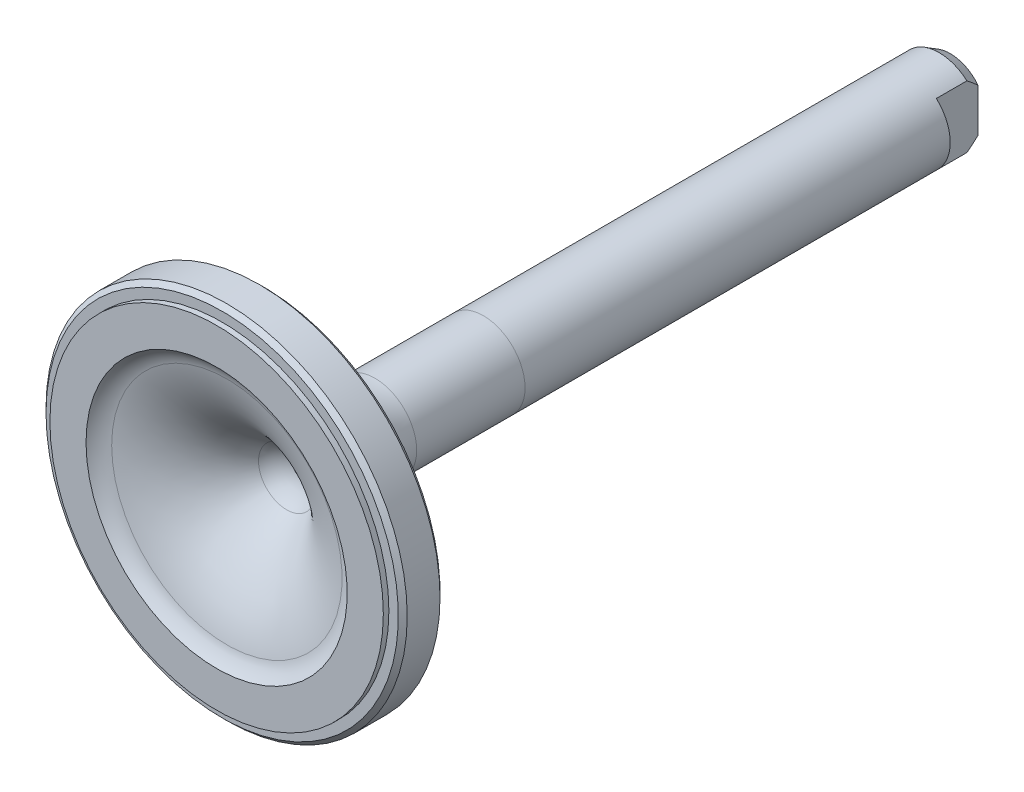
ISO-10303-21;
HEADER;
FILE_DESCRIPTION(('STEP AP214'),'2;1');
FILE_NAME('part.step','',(''),(''),'','','');
FILE_SCHEMA(('AUTOMOTIVE_DESIGN { 1 0 10303 214 1 1 1 1 }'));
ENDSEC;
DATA;
#1=APPLICATION_CONTEXT('core data for automotive mechanical design processes');
#2=APPLICATION_PROTOCOL_DEFINITION('international standard','automotive_design',2000,#1);
#3=PRODUCT_CONTEXT('',#1,'mechanical');
#4=PRODUCT('Part','Part','',(#3));
#5=PRODUCT_RELATED_PRODUCT_CATEGORY('part','',(#4));
#6=PRODUCT_DEFINITION_FORMATION('','',#4);
#7=PRODUCT_DEFINITION_CONTEXT('part definition',#1,'design');
#8=PRODUCT_DEFINITION('design','',#6,#7);
#9=PRODUCT_DEFINITION_SHAPE('','',#8);
#10=(LENGTH_UNIT() NAMED_UNIT(*) SI_UNIT(.MILLI.,.METRE.));
#11=(NAMED_UNIT(*) PLANE_ANGLE_UNIT() SI_UNIT($,.RADIAN.));
#12=(NAMED_UNIT(*) SI_UNIT($,.STERADIAN.) SOLID_ANGLE_UNIT());
#13=UNCERTAINTY_MEASURE_WITH_UNIT(LENGTH_MEASURE(1.E-05),#10,'distance_accuracy_value','');
#14=(GEOMETRIC_REPRESENTATION_CONTEXT(3) GLOBAL_UNCERTAINTY_ASSIGNED_CONTEXT((#13)) GLOBAL_UNIT_ASSIGNED_CONTEXT((#10,
#11,#12)) REPRESENTATION_CONTEXT('',''));
#15=CARTESIAN_POINT('',(0.,0.,0.));
#16=DIRECTION('',(0.,0.,1.));
#17=DIRECTION('',(1.,0.,0.));
#18=AXIS2_PLACEMENT_3D('',#15,#16,#17);
#19=CARTESIAN_POINT('',(0.,0.,-156.845));
#20=DIRECTION('',(0.,0.,1.));
#21=DIRECTION('',(1.,0.,0.));
#22=AXIS2_PLACEMENT_3D('',#19,#20,#21);
#23=CYLINDRICAL_SURFACE('',#22,9.525);
#24=CARTESIAN_POINT('',(0.,0.,-25.4));
#25=DIRECTION('',(0.,0.,1.));
#26=DIRECTION('',(1.,0.,0.));
#27=AXIS2_PLACEMENT_3D('',#24,#25,#26);
#28=CIRCLE('',#27,9.525);
#29=CARTESIAN_POINT('',(9.525,0.,-25.4));
#30=VERTEX_POINT('',#29);
#31=EDGE_CURVE('E168',#30,#30,#28,.F.);
#32=ORIENTED_EDGE('',*,*,#31,.T.);
#33=EDGE_LOOP('',(#32));
#34=FACE_BOUND('',#33,.T.);
#35=CARTESIAN_POINT('',(0.,0.,-50.165));
#36=DIRECTION('',(0.,0.,-1.));
#37=DIRECTION('',(0.,1.,0.));
#38=AXIS2_PLACEMENT_3D('',#35,#36,#37);
#39=CIRCLE('',#38,9.525);
#40=CARTESIAN_POINT('',(0.,9.525,-50.165));
#41=VERTEX_POINT('',#40);
#42=EDGE_CURVE('E13',#41,#41,#39,.T.);
#43=ORIENTED_EDGE('',*,*,#42,.F.);
#44=EDGE_LOOP('',(#43));
#45=FACE_BOUND('',#44,.T.);
#46=ADVANCED_FACE('F51',(#34,#45),#23,.T.);
#47=CARTESIAN_POINT('',(0.,0.,9.525));
#48=DIRECTION('',(0.,0.,1.));
#49=DIRECTION('',(1.,0.,0.));
#50=AXIS2_PLACEMENT_3D('',#47,#48,#49);
#51=PLANE('',#50);
#52=CARTESIAN_POINT('',(0.,0.,9.525));
#53=DIRECTION('',(0.,0.,1.));
#54=DIRECTION('',(1.,0.,0.));
#55=AXIS2_PLACEMENT_3D('',#52,#53,#54);
#56=CIRCLE('',#55,38.1);
#57=CARTESIAN_POINT('',(38.1,0.,9.525));
#58=VERTEX_POINT('',#57);
#59=EDGE_CURVE('E152',#58,#58,#56,.T.);
#60=ORIENTED_EDGE('',*,*,#59,.F.);
#61=EDGE_LOOP('',(#60));
#62=FACE_BOUND('',#61,.T.);
#63=CARTESIAN_POINT('',(0.,0.,9.525));
#64=DIRECTION('',(0.,0.,-1.));
#65=DIRECTION('',(-1.,0.,0.));
#66=AXIS2_PLACEMENT_3D('',#63,#64,#65);
#67=CIRCLE('',#66,40.259);
#68=CARTESIAN_POINT('',(-40.259,0.,9.525));
#69=VERTEX_POINT('',#68);
#70=EDGE_CURVE('E334',#69,#69,#67,.T.);
#71=ORIENTED_EDGE('',*,*,#70,.F.);
#72=EDGE_LOOP('',(#71));
#73=FACE_BOUND('',#72,.T.);
#74=ADVANCED_FACE('F209',(#62,#73),#51,.T.);
#75=CARTESIAN_POINT('',(0.,0.,10.795));
#76=DIRECTION('',(0.,0.,1.));
#77=DIRECTION('',(1.,0.,0.));
#78=AXIS2_PLACEMENT_3D('',#75,#76,#77);
#79=PLANE('',#78);
#80=CARTESIAN_POINT('',(0.,0.,10.795));
#81=DIRECTION('',(0.,0.,1.));
#82=DIRECTION('',(1.,0.,0.));
#83=AXIS2_PLACEMENT_3D('',#80,#81,#82);
#84=CIRCLE('',#83,38.1);
#85=CARTESIAN_POINT('',(38.1,0.,10.795));
#86=VERTEX_POINT('',#85);
#87=EDGE_CURVE('E146',#86,#86,#84,.T.);
#88=ORIENTED_EDGE('',*,*,#87,.T.);
#89=EDGE_LOOP('',(#88));
#90=FACE_BOUND('',#89,.T.);
#91=CARTESIAN_POINT('',(0.,0.,10.795));
#92=DIRECTION('',(0.,0.,-1.));
#93=DIRECTION('',(-1.,0.,0.));
#94=AXIS2_PLACEMENT_3D('',#91,#92,#93);
#95=CIRCLE('',#94,29.845);
#96=CARTESIAN_POINT('',(-29.845,0.,10.795));
#97=VERTEX_POINT('',#96);
#98=EDGE_CURVE('E305',#97,#97,#95,.T.);
#99=ORIENTED_EDGE('',*,*,#98,.T.);
#100=EDGE_LOOP('',(#99));
#101=FACE_BOUND('',#100,.T.);
#102=ADVANCED_FACE('F205',(#90,#101),#79,.T.);
#103=CARTESIAN_POINT('',(0.,0.,9.525));
#104=DIRECTION('',(0.,0.,1.));
#105=DIRECTION('',(1.,0.,0.));
#106=AXIS2_PLACEMENT_3D('',#103,#104,#105);
#107=CYLINDRICAL_SURFACE('',#106,38.1);
#108=ORIENTED_EDGE('',*,*,#59,.T.);
#109=EDGE_LOOP('',(#108));
#110=FACE_BOUND('',#109,.T.);
#111=ORIENTED_EDGE('',*,*,#87,.F.);
#112=EDGE_LOOP('',(#111));
#113=FACE_BOUND('',#112,.T.);
#114=ADVANCED_FACE('F208',(#110,#113),#107,.T.);
#115=CARTESIAN_POINT('',(0.,0.,14.605));
#116=DIRECTION('',(0.,0.,-1.));
#117=DIRECTION('',(-1.,0.,0.));
#118=AXIS2_PLACEMENT_3D('',#115,#116,#117);
#119=TOROIDAL_SURFACE('',#118,24.765,6.35);
#120=CARTESIAN_POINT('',(0.,0.,8.45038461538461));
#121=DIRECTION('',(0.,0.,-1.));
#122=DIRECTION('',(-1.,0.,0.));
#123=AXIS2_PLACEMENT_3D('',#120,#121,#122);
#124=CIRCLE('',#123,26.3280769230769);
#125=CARTESIAN_POINT('',(-26.3280769230769,0.,8.45038461538461));
#126=VERTEX_POINT('',#125);
#127=EDGE_CURVE('E311',#126,#126,#124,.T.);
#128=ORIENTED_EDGE('',*,*,#127,.T.);
#129=EDGE_LOOP('',(#128));
#130=FACE_BOUND('',#129,.T.);
#131=ORIENTED_EDGE('',*,*,#98,.F.);
#132=EDGE_LOOP('',(#131));
#133=FACE_BOUND('',#132,.T.);
#134=ADVANCED_FACE('F258',(#130,#133),#119,.F.);
#135=CARTESIAN_POINT('',(0.,0.,-25.4));
#136=DIRECTION('',(0.,0.,-1.));
#137=DIRECTION('',(-1.,0.,0.));
#138=AXIS2_PLACEMENT_3D('',#135,#136,#137);
#139=DEGENERATE_TOROIDAL_SURFACE('',#138,34.925,34.925,.T.);
#140=CARTESIAN_POINT('',(0.,0.,-5.21270777702834));
#141=DIRECTION('',(0.,0.,-1.));
#142=DIRECTION('',(-1.,0.,0.));
#143=AXIS2_PLACEMENT_3D('',#140,#141,#142);
#144=CIRCLE('',#143,6.4253709198813);
#145=CARTESIAN_POINT('',(-6.4253709198813,0.,-5.21270777702834));
#146=VERTEX_POINT('',#145);
#147=EDGE_CURVE('E314',#146,#146,#144,.T.);
#148=ORIENTED_EDGE('',*,*,#147,.T.);
#149=EDGE_LOOP('',(#148));
#150=FACE_BOUND('',#149,.T.);
#151=ORIENTED_EDGE('',*,*,#127,.F.);
#152=EDGE_LOOP('',(#151));
#153=FACE_BOUND('',#152,.T.);
#154=ADVANCED_FACE('F357',(#150,#153),#139,.T.);
#155=CARTESIAN_POINT('',(0.,0.,-0.661390984940169));
#156=DIRECTION('',(0.,0.,-1.));
#157=DIRECTION('',(1.,0.,0.));
#158=AXIS2_PLACEMENT_3D('',#155,#156,#157);
#159=SPHERICAL_SURFACE('',#158,7.874);
#160=CARTESIAN_POINT('',(0.,0.,-8.37370060981909));
#161=DIRECTION('',(0.,0.,-1.));
#162=DIRECTION('',(-1.,0.,0.));
#163=AXIS2_PLACEMENT_3D('',#160,#161,#162);
#164=CIRCLE('',#163,1.5875);
#165=CARTESIAN_POINT('',(-1.5875,0.,-8.37370060981909));
#166=VERTEX_POINT('',#165);
#167=EDGE_CURVE('E316',#166,#166,#164,.T.);
#168=ORIENTED_EDGE('',*,*,#167,.T.);
#169=EDGE_LOOP('',(#168));
#170=FACE_BOUND('',#169,.T.);
#171=ORIENTED_EDGE('',*,*,#147,.F.);
#172=EDGE_LOOP('',(#171));
#173=FACE_BOUND('',#172,.T.);
#174=ADVANCED_FACE('F353',(#170,#173),#159,.F.);
#175=CARTESIAN_POINT('',(0.,0.,10.795));
#176=DIRECTION('',(0.,0.,-1.));
#177=DIRECTION('',(-1.,0.,0.));
#178=AXIS2_PLACEMENT_3D('',#175,#176,#177);
#179=CYLINDRICAL_SURFACE('',#178,1.5875);
#180=CARTESIAN_POINT('',(0.,0.,-8.91639098494017));
#181=DIRECTION('',(0.,0.,-1.));
#182=DIRECTION('',(-1.,0.,0.));
#183=AXIS2_PLACEMENT_3D('',#180,#181,#182);
#184=CIRCLE('',#183,1.5875);
#185=CARTESIAN_POINT('',(-1.5875,0.,-8.91639098494017));
#186=VERTEX_POINT('',#185);
#187=EDGE_CURVE('E270',#186,#186,#184,.T.);
#188=ORIENTED_EDGE('',*,*,#187,.T.);
#189=EDGE_LOOP('',(#188));
#190=FACE_BOUND('',#189,.T.);
#191=ORIENTED_EDGE('',*,*,#167,.F.);
#192=EDGE_LOOP('',(#191));
#193=FACE_BOUND('',#192,.T.);
#194=ADVANCED_FACE('F346',(#190,#193),#179,.F.);
#195=CARTESIAN_POINT('',(0.,0.,-8.91639098494017));
#196=DIRECTION('',(0.,0.,1.));
#197=DIRECTION('',(1.,0.,0.));
#198=AXIS2_PLACEMENT_3D('',#195,#196,#197);
#199=PLANE('',#198);
#200=ORIENTED_EDGE('',*,*,#187,.F.);
#201=EDGE_LOOP('',(#200));
#202=FACE_BOUND('',#201,.T.);
#203=ADVANCED_FACE('F278',(#202),#199,.T.);
#204=CARTESIAN_POINT('',(0.,0.,8.509));
#205=DIRECTION('',(0.,0.,-1.));
#206=DIRECTION('',(-1.,0.,0.));
#207=AXIS2_PLACEMENT_3D('',#204,#205,#206);
#208=CONICAL_SURFACE('',#207,41.275,0.785398163397448);
#209=ORIENTED_EDGE('',*,*,#70,.T.);
#210=EDGE_LOOP('',(#209));
#211=FACE_BOUND('',#210,.T.);
#212=CARTESIAN_POINT('',(0.,0.,8.509));
#213=DIRECTION('',(0.,0.,-1.));
#214=DIRECTION('',(-1.,0.,0.));
#215=AXIS2_PLACEMENT_3D('',#212,#213,#214);
#216=CIRCLE('',#215,41.275);
#217=CARTESIAN_POINT('',(-41.275,0.,8.509));
#218=VERTEX_POINT('',#217);
#219=EDGE_CURVE('E337',#218,#218,#216,.T.);
#220=ORIENTED_EDGE('',*,*,#219,.F.);
#221=EDGE_LOOP('',(#220));
#222=FACE_BOUND('',#221,.T.);
#223=ADVANCED_FACE('F200',(#211,#222),#208,.T.);
#224=CARTESIAN_POINT('',(0.,0.,-156.845));
#225=DIRECTION('',(0.,0.,-1.));
#226=DIRECTION('',(-1.,0.,0.));
#227=AXIS2_PLACEMENT_3D('',#224,#225,#226);
#228=PLANE('',#227);
#229=CARTESIAN_POINT('',(0.,0.,-156.845));
#230=DIRECTION('',(0.,0.,1.));
#231=DIRECTION('',(1.,0.,0.));
#232=AXIS2_PLACEMENT_3D('',#229,#230,#231);
#233=CIRCLE('',#232,8.05853031625838);
#234=CARTESIAN_POINT('',(-6.35,-4.96159358049965,-156.845));
#235=VERTEX_POINT('',#234);
#236=CARTESIAN_POINT('',(6.35,-4.96159358049965,-156.845));
#237=VERTEX_POINT('',#236);
#238=EDGE_CURVE('E125',#235,#237,#233,.T.);
#239=ORIENTED_EDGE('',*,*,#238,.F.);
#240=DIRECTION('',(0.,1.,0.));
#241=VECTOR('',#240,1.);
#242=CARTESIAN_POINT('',(-6.35,0.,-156.845));
#243=LINE('',#242,#241);
#244=CARTESIAN_POINT('',(-6.35,4.96159358049965,-156.845));
#245=VERTEX_POINT('',#244);
#246=EDGE_CURVE('E303',#235,#245,#243,.T.);
#247=ORIENTED_EDGE('',*,*,#246,.T.);
#248=CARTESIAN_POINT('',(6.35,4.96159358049965,-156.845));
#249=VERTEX_POINT('',#248);
#250=EDGE_CURVE('E68',#249,#245,#233,.T.);
#251=ORIENTED_EDGE('',*,*,#250,.F.);
#252=DIRECTION('',(0.,1.,0.));
#253=VECTOR('',#252,1.);
#254=CARTESIAN_POINT('',(6.35,0.,-156.845));
#255=LINE('',#254,#253);
#256=EDGE_CURVE('E136',#237,#249,#255,.T.);
#257=ORIENTED_EDGE('',*,*,#256,.F.);
#258=EDGE_LOOP('',(#239,#247,#251,#257));
#259=FACE_BOUND('',#258,.T.);
#260=ADVANCED_FACE('F196',(#259),#228,.T.);
#261=CARTESIAN_POINT('',(12.7,-41.275,-147.32));
#262=DIRECTION('',(0.,0.,1.));
#263=DIRECTION('',(1.,0.,0.));
#264=AXIS2_PLACEMENT_3D('',#261,#262,#263);
#265=PLANE('',#264);
#266=DIRECTION('',(0.,1.,0.));
#267=VECTOR('',#266,1.);
#268=CARTESIAN_POINT('',(6.35,-41.275,-147.32));
#269=LINE('',#268,#267);
#270=CARTESIAN_POINT('',(6.35,-7.09951582856183,-147.32));
#271=VERTEX_POINT('',#270);
#272=CARTESIAN_POINT('',(6.35,7.09951582856183,-147.32));
#273=VERTEX_POINT('',#272);
#274=EDGE_CURVE('E144',#271,#273,#269,.T.);
#275=ORIENTED_EDGE('',*,*,#274,.T.);
#276=CARTESIAN_POINT('',(0.,0.,-147.32));
#277=DIRECTION('',(0.,0.,1.));
#278=DIRECTION('',(1.,0.,0.));
#279=AXIS2_PLACEMENT_3D('',#276,#277,#278);
#280=CIRCLE('',#279,9.525);
#281=EDGE_CURVE('E142',#271,#273,#280,.T.);
#282=ORIENTED_EDGE('',*,*,#281,.F.);
#283=EDGE_LOOP('',(#275,#282));
#284=FACE_BOUND('',#283,.T.);
#285=ADVANCED_FACE('F199',(#284),#265,.F.);
#286=CARTESIAN_POINT('',(0.,0.,-156.845));
#287=DIRECTION('',(0.,0.,1.));
#288=DIRECTION('',(1.,0.,0.));
#289=AXIS2_PLACEMENT_3D('',#286,#287,#288);
#290=CONICAL_SURFACE('',#289,8.05853031625838,0.523598775598293);
#291=CARTESIAN_POINT('',(0.,0.,-154.305));
#292=DIRECTION('',(0.,0.,1.));
#293=DIRECTION('',(1.,0.,0.));
#294=AXIS2_PLACEMENT_3D('',#291,#292,#293);
#295=CIRCLE('',#294,9.525);
#296=CARTESIAN_POINT('',(-6.35,-7.09951582856183,-154.305));
#297=VERTEX_POINT('',#296);
#298=CARTESIAN_POINT('',(6.35000000000002,-7.09951582856182,-154.305));
#299=VERTEX_POINT('',#298);
#300=EDGE_CURVE('E76',#297,#299,#295,.T.);
#301=ORIENTED_EDGE('',*,*,#300,.F.);
#302=CARTESIAN_POINT('',(-6.35,-13.0599618695712,-145.650143681));
#303=CARTESIAN_POINT('',(-6.35,-12.7557389839278,-146.123941760175));
#304=CARTESIAN_POINT('',(-6.35,-12.4501473483473,-146.596869587332));
#305=CARTESIAN_POINT('',(-6.35,-11.835389104833,-147.540479010959));
#306=CARTESIAN_POINT('',(-6.35,-11.5262220532061,-148.011160318181));
#307=CARTESIAN_POINT('',(-6.35,-10.9017322334413,-148.952393720973));
#308=CARTESIAN_POINT('',(-6.35,-10.5863840520287,-149.422928990894));
#309=CARTESIAN_POINT('',(-6.35,-9.95014478246995,-150.360192174322));
#310=CARTESIAN_POINT('',(-6.35,-9.62925410187274,-150.826920364086));
#311=CARTESIAN_POINT('',(-6.35,-8.9802092318368,-151.755495718746));
#312=CARTESIAN_POINT('',(-6.35,-8.65205325572264,-152.2173416408));
#313=CARTESIAN_POINT('',(-6.35,-8.15260960058968,-152.904955973015));
#314=CARTESIAN_POINT('',(-6.35,-7.98490646424969,-153.133328418624));
#315=CARTESIAN_POINT('',(-6.35,-7.64669741144129,-153.587986296261));
#316=CARTESIAN_POINT('',(-6.35,-7.47619154088946,-153.814271762386));
#317=CARTESIAN_POINT('',(-6.35,-7.13238249731842,-154.263676075563));
#318=CARTESIAN_POINT('',(-6.35,-6.95908883011622,-154.486802182973));
#319=CARTESIAN_POINT('',(-6.35,-6.6086186239073,-154.92997795349));
#320=CARTESIAN_POINT('',(-6.35,-6.43144222960473,-155.150027730748));
#321=CARTESIAN_POINT('',(-6.35,-6.07248881151088,-155.586220846909));
#322=CARTESIAN_POINT('',(-6.35,-5.89071344178955,-155.80236554369));
#323=CARTESIAN_POINT('',(-6.35,-5.52152725537206,-156.229773165407));
#324=CARTESIAN_POINT('',(-6.35,-5.33411705398541,-156.44103661894));
#325=CARTESIAN_POINT('',(-6.35,-5.01258993922061,-156.791544333848));
#326=CARTESIAN_POINT('',(-6.35,-4.88031692983781,-156.932478529333));
#327=CARTESIAN_POINT('',(-6.35,-4.6119894957811,-157.210721579824));
#328=CARTESIAN_POINT('',(-6.35,-4.4759349511796,-157.348030319582));
#329=CARTESIAN_POINT('',(-6.35,-4.19905894657514,-157.618533134339));
#330=CARTESIAN_POINT('',(-6.35,-4.05822561059008,-157.751715102195));
#331=CARTESIAN_POINT('',(-6.35,-3.77140445925485,-158.012426329878));
#332=CARTESIAN_POINT('',(-6.35,-3.62541683955835,-158.139955803857));
#333=CARTESIAN_POINT('',(-6.35,-3.32576159184236,-158.389196107969));
#334=CARTESIAN_POINT('',(-6.35,-3.17202672920256,-158.510826689556));
#335=CARTESIAN_POINT('',(-6.35,-2.85735136373754,-158.744583074401));
#336=CARTESIAN_POINT('',(-6.35,-2.69640845197702,-158.856705663308));
#337=CARTESIAN_POINT('',(-6.35,-2.36695644796914,-159.068005165537));
#338=CARTESIAN_POINT('',(-6.35,-2.19847729589359,-159.167228085647));
#339=CARTESIAN_POINT('',(-6.35,-1.8529422286007,-159.34912152188));
#340=CARTESIAN_POINT('',(-6.35,-1.67589535928737,-159.431809042343));
#341=CARTESIAN_POINT('',(-6.35,-1.28626401801675,-159.586343267144));
#342=CARTESIAN_POINT('',(-6.35,-1.07227702798958,-159.654818741671));
#343=CARTESIAN_POINT('',(-6.35,-0.745267020536254,-159.730359252406));
#344=CARTESIAN_POINT('',(-6.35,-0.635304712693461,-159.751007757829));
#345=CARTESIAN_POINT('',(-6.35,-0.413961278858516,-159.782567072742));
#346=CARTESIAN_POINT('',(-6.35,-0.302580184105183,-159.793478096258));
#347=CARTESIAN_POINT('',(-6.35,-0.0786958195290015,-159.805133774009));
#348=CARTESIAN_POINT('',(-6.35,0.0338102704798267,-159.805824489484));
#349=CARTESIAN_POINT('',(-6.35,0.258405791882696,-159.796876066075));
#350=CARTESIAN_POINT('',(-6.35,0.370495226702308,-159.787237012308));
#351=CARTESIAN_POINT('',(-6.35,0.593410138386659,-159.758019439988));
#352=CARTESIAN_POINT('',(-6.35,0.70423501530392,-159.738436389044));
#353=CARTESIAN_POINT('',(-6.35,0.923900250524655,-159.690060604672));
#354=CARTESIAN_POINT('',(-6.35,1.03273935605224,-159.661262256372));
#355=CARTESIAN_POINT('',(-6.35,1.28555872487847,-159.583862795708));
#356=CARTESIAN_POINT('',(-6.35,1.42849775758304,-159.531858582667));
#357=CARTESIAN_POINT('',(-6.35,1.70916797806486,-159.415270726408));
#358=CARTESIAN_POINT('',(-6.35,1.84689563272353,-159.350678725362));
#359=CARTESIAN_POINT('',(-6.35,2.11745653578588,-159.211055628832));
#360=CARTESIAN_POINT('',(-6.35,2.25027288849831,-159.135992096739));
#361=CARTESIAN_POINT('',(-6.35,2.51079241737925,-158.977593570577));
#362=CARTESIAN_POINT('',(-6.35,2.63849658458379,-158.894260190687));
#363=CARTESIAN_POINT('',(-6.35,2.94549886619335,-158.6820556836));
#364=CARTESIAN_POINT('',(-6.35,3.1222566226186,-158.549519983826));
#365=CARTESIAN_POINT('',(-6.35,3.46754008881407,-158.274073361409));
#366=CARTESIAN_POINT('',(-6.35,3.63606114895273,-158.131156689308));
#367=CARTESIAN_POINT('',(-6.35,3.96648044858622,-157.837213296378));
#368=CARTESIAN_POINT('',(-6.35,4.12836371939288,-157.686169849951));
#369=CARTESIAN_POINT('',(-6.35,4.44622867208586,-157.378092414212));
#370=CARTESIAN_POINT('',(-6.35,4.60221151907853,-157.221059619995));
#371=CARTESIAN_POINT('',(-6.35,4.91087163113796,-156.900581171734));
#372=CARTESIAN_POINT('',(-6.35,5.06349652962579,-156.737085278511));
#373=CARTESIAN_POINT('',(-6.35,5.36450360844346,-156.406234615868));
#374=CARTESIAN_POINT('',(-6.35,5.51288562280192,-156.238879695954));
#375=CARTESIAN_POINT('',(-6.35,5.80584615472156,-155.901266638499));
#376=CARTESIAN_POINT('',(-6.35,5.95042942161682,-155.731012612318));
#377=CARTESIAN_POINT('',(-6.35,6.23651008705603,-155.387927321771));
#378=CARTESIAN_POINT('',(-6.35,6.37800737347203,-155.215095964143));
#379=CARTESIAN_POINT('',(-6.35,6.82512721160883,-154.660407800981));
#380=CARTESIAN_POINT('',(-6.35,7.12573031638621,-154.274503532159));
#381=CARTESIAN_POINT('',(-6.35,7.7175702115932,-153.495569501124));
#382=CARTESIAN_POINT('',(-6.35,8.00880599088692,-153.102538976796));
#383=CARTESIAN_POINT('',(-6.35,8.58437040589414,-152.310895662383));
#384=CARTESIAN_POINT('',(-6.35,8.86869224478811,-151.912277941887));
#385=CARTESIAN_POINT('',(-6.35,9.43172286395234,-151.111097425241));
#386=CARTESIAN_POINT('',(-6.35,9.71043153566444,-150.708534553014));
#387=CARTESIAN_POINT('',(-6.35,10.2495881132624,-149.920491478326));
#388=CARTESIAN_POINT('',(-6.35,10.5102537598489,-149.535159988569));
#389=CARTESIAN_POINT('',(-6.35,11.0282748974019,-148.762271822334));
#390=CARTESIAN_POINT('',(-6.35,11.2856303345632,-148.374715109834));
#391=CARTESIAN_POINT('',(-6.35,11.7971316969671,-147.598499019488));
#392=CARTESIAN_POINT('',(-6.35,12.0512825952492,-147.209842914785));
#393=CARTESIAN_POINT('',(-6.35,12.5572588706784,-146.4310406785));
#394=CARTESIAN_POINT('',(-6.35,12.8090843374625,-146.040894605175));
#395=CARTESIAN_POINT('',(-6.35,13.0599618695712,-145.650143681));
#396=B_SPLINE_CURVE_WITH_KNOTS('',3,(#302,#303,#304,#305,#306,#307,#308,#309,#310,#311,#312,
#313,#314,#315,#316,#317,#318,#319,#320,#321,#322,#323,#324,#325,#326,#327,#328,#329,#330,#331,
#332,#333,#334,#335,#336,#337,#338,#339,#340,#341,#342,#343,#344,#345,#346,#347,#348,#349,#350,
#351,#352,#353,#354,#355,#356,#357,#358,#359,#360,#361,#362,#363,#364,#365,#366,#367,#368,#369,
#370,#371,#372,#373,#374,#375,#376,#377,#378,#379,#380,#381,#382,#383,#384,#385,#386,#387,#388,
#389,#390,#391,#392,#393,#394,#395),.UNSPECIFIED.,.F.,.F.,(4,2,2,2,2,2,2,2,2,2,2,2,2,2,2,2,2,2,
2,2,2,2,2,2,2,2,2,2,2,2,2,2,2,2,2,2,2,2,2,2,2,2,2,2,2,2,4),(0.,1.68918736928819,
3.37858665782325,5.07785749623132,6.77700391200378,8.47657292663938,9.32655893036799,
10.1765310228062,11.0240472507205,11.8715319463523,12.7187160506857,13.5658079782331,
14.1456022711109,14.7254149726113,15.3067927583335,15.8881484989637,16.4759538397551,
17.0639571132004,17.6498021077488,18.2350415092092,18.9061584214642,19.2414442514049,
19.5767227117468,19.9137700123864,20.2508145358021,20.5880128194179,20.9254169501315,
21.3809769838321,21.8368405295802,22.2941488791722,22.7513681424567,23.4135940398527,
24.0761895467797,24.7402051816318,25.4040890071621,26.0749900254071,26.7459172518745,
27.4159613594998,28.0860297725035,29.5533018136119,31.0207317083262,32.4895501911582,
33.9583970535858,35.3540278898776,36.7496813825798,38.1428044857302,39.535873662954),.UNSPECIFIED.);
#397=EDGE_CURVE('E61',#297,#235,#396,.T.);
#398=ORIENTED_EDGE('',*,*,#397,.T.);
#399=ORIENTED_EDGE('',*,*,#238,.T.);
#400=CARTESIAN_POINT('',(6.35,-13.0599618695712,-145.650143681));
#401=CARTESIAN_POINT('',(6.35,-12.7557389839278,-146.123941760175));
#402=CARTESIAN_POINT('',(6.35,-12.4501473483473,-146.596869587332));
#403=CARTESIAN_POINT('',(6.35,-11.835389104833,-147.540479010959));
#404=CARTESIAN_POINT('',(6.35,-11.5262220532061,-148.011160318181));
#405=CARTESIAN_POINT('',(6.35,-10.9017322334413,-148.952393720973));
#406=CARTESIAN_POINT('',(6.35,-10.5863840520287,-149.422928990894));
#407=CARTESIAN_POINT('',(6.35,-9.95014478246995,-150.360192174322));
#408=CARTESIAN_POINT('',(6.35,-9.62925410187274,-150.826920364086));
#409=CARTESIAN_POINT('',(6.35,-8.9802092318368,-151.755495718746));
#410=CARTESIAN_POINT('',(6.35,-8.65205325572264,-152.2173416408));
#411=CARTESIAN_POINT('',(6.35,-8.15260960058968,-152.904955973015));
#412=CARTESIAN_POINT('',(6.35,-7.98490646424969,-153.133328418624));
#413=CARTESIAN_POINT('',(6.35,-7.64669741144129,-153.587986296261));
#414=CARTESIAN_POINT('',(6.35,-7.47619154088946,-153.814271762386));
#415=CARTESIAN_POINT('',(6.35,-7.13238249731842,-154.263676075563));
#416=CARTESIAN_POINT('',(6.35,-6.95908883011622,-154.486802182973));
#417=CARTESIAN_POINT('',(6.35,-6.6086186239073,-154.92997795349));
#418=CARTESIAN_POINT('',(6.35,-6.43144222960473,-155.150027730748));
#419=CARTESIAN_POINT('',(6.35,-6.07248881151088,-155.586220846909));
#420=CARTESIAN_POINT('',(6.35,-5.89071344178955,-155.80236554369));
#421=CARTESIAN_POINT('',(6.35,-5.52152725537206,-156.229773165407));
#422=CARTESIAN_POINT('',(6.35,-5.33411705398541,-156.44103661894));
#423=CARTESIAN_POINT('',(6.35,-5.01258993922061,-156.791544333848));
#424=CARTESIAN_POINT('',(6.35,-4.88031692983781,-156.932478529333));
#425=CARTESIAN_POINT('',(6.35,-4.6119894957811,-157.210721579824));
#426=CARTESIAN_POINT('',(6.35,-4.4759349511796,-157.348030319582));
#427=CARTESIAN_POINT('',(6.35,-4.19905894657514,-157.618533134339));
#428=CARTESIAN_POINT('',(6.35,-4.05822561059008,-157.751715102195));
#429=CARTESIAN_POINT('',(6.35,-3.77140445925485,-158.012426329878));
#430=CARTESIAN_POINT('',(6.35,-3.62541683955835,-158.139955803857));
#431=CARTESIAN_POINT('',(6.35,-3.32576159184236,-158.389196107969));
#432=CARTESIAN_POINT('',(6.35,-3.17202672920256,-158.510826689556));
#433=CARTESIAN_POINT('',(6.35,-2.85735136373754,-158.744583074401));
#434=CARTESIAN_POINT('',(6.35,-2.69640845197702,-158.856705663308));
#435=CARTESIAN_POINT('',(6.35,-2.36695644796914,-159.068005165537));
#436=CARTESIAN_POINT('',(6.35,-2.19847729589359,-159.167228085647));
#437=CARTESIAN_POINT('',(6.35,-1.8529422286007,-159.34912152188));
#438=CARTESIAN_POINT('',(6.35,-1.67589535928737,-159.431809042343));
#439=CARTESIAN_POINT('',(6.35,-1.28626401801675,-159.586343267144));
#440=CARTESIAN_POINT('',(6.35,-1.07227702798958,-159.654818741671));
#441=CARTESIAN_POINT('',(6.35,-0.745267020536254,-159.730359252406));
#442=CARTESIAN_POINT('',(6.35,-0.635304712693461,-159.751007757829));
#443=CARTESIAN_POINT('',(6.35,-0.413961278858516,-159.782567072742));
#444=CARTESIAN_POINT('',(6.35,-0.302580184105183,-159.793478096258));
#445=CARTESIAN_POINT('',(6.35,-0.0786958195290015,-159.805133774009));
#446=CARTESIAN_POINT('',(6.35,0.0338102704798267,-159.805824489484));
#447=CARTESIAN_POINT('',(6.35,0.258405791882696,-159.796876066075));
#448=CARTESIAN_POINT('',(6.35,0.370495226702308,-159.787237012308));
#449=CARTESIAN_POINT('',(6.35,0.593410138386659,-159.758019439988));
#450=CARTESIAN_POINT('',(6.35,0.70423501530392,-159.738436389044));
#451=CARTESIAN_POINT('',(6.35,0.923900250524655,-159.690060604672));
#452=CARTESIAN_POINT('',(6.35,1.03273935605224,-159.661262256372));
#453=CARTESIAN_POINT('',(6.35,1.28555872487847,-159.583862795708));
#454=CARTESIAN_POINT('',(6.35,1.42849775758304,-159.531858582667));
#455=CARTESIAN_POINT('',(6.35,1.70916797806486,-159.415270726408));
#456=CARTESIAN_POINT('',(6.35,1.84689563272353,-159.350678725362));
#457=CARTESIAN_POINT('',(6.35,2.11745653578588,-159.211055628832));
#458=CARTESIAN_POINT('',(6.35,2.25027288849831,-159.135992096739));
#459=CARTESIAN_POINT('',(6.35,2.51079241737925,-158.977593570577));
#460=CARTESIAN_POINT('',(6.35,2.63849658458379,-158.894260190687));
#461=CARTESIAN_POINT('',(6.35,2.94549886619335,-158.6820556836));
#462=CARTESIAN_POINT('',(6.35,3.1222566226186,-158.549519983826));
#463=CARTESIAN_POINT('',(6.35,3.46754008881407,-158.274073361409));
#464=CARTESIAN_POINT('',(6.35,3.63606114895273,-158.131156689308));
#465=CARTESIAN_POINT('',(6.35,3.96648044858622,-157.837213296378));
#466=CARTESIAN_POINT('',(6.35,4.12836371939288,-157.686169849951));
#467=CARTESIAN_POINT('',(6.35,4.44622867208586,-157.378092414212));
#468=CARTESIAN_POINT('',(6.35,4.60221151907853,-157.221059619995));
#469=CARTESIAN_POINT('',(6.35,4.91087163113796,-156.900581171734));
#470=CARTESIAN_POINT('',(6.35,5.06349652962579,-156.737085278511));
#471=CARTESIAN_POINT('',(6.35,5.36450360844346,-156.406234615868));
#472=CARTESIAN_POINT('',(6.35,5.51288562280192,-156.238879695954));
#473=CARTESIAN_POINT('',(6.35,5.80584615472156,-155.901266638499));
#474=CARTESIAN_POINT('',(6.35,5.95042942161682,-155.731012612318));
#475=CARTESIAN_POINT('',(6.35,6.23651008705603,-155.387927321771));
#476=CARTESIAN_POINT('',(6.35,6.37800737347203,-155.215095964143));
#477=CARTESIAN_POINT('',(6.35,6.82512721160883,-154.660407800981));
#478=CARTESIAN_POINT('',(6.35,7.12573031638621,-154.274503532159));
#479=CARTESIAN_POINT('',(6.35,7.7175702115932,-153.495569501124));
#480=CARTESIAN_POINT('',(6.35,8.00880599088692,-153.102538976796));
#481=CARTESIAN_POINT('',(6.35,8.58437040589414,-152.310895662383));
#482=CARTESIAN_POINT('',(6.35,8.86869224478811,-151.912277941887));
#483=CARTESIAN_POINT('',(6.35,9.43172286395234,-151.111097425241));
#484=CARTESIAN_POINT('',(6.35,9.71043153566444,-150.708534553014));
#485=CARTESIAN_POINT('',(6.35,10.2495881132624,-149.920491478326));
#486=CARTESIAN_POINT('',(6.35,10.5102537598489,-149.535159988569));
#487=CARTESIAN_POINT('',(6.35,11.0282748974019,-148.762271822334));
#488=CARTESIAN_POINT('',(6.35,11.2856303345632,-148.374715109834));
#489=CARTESIAN_POINT('',(6.35,11.7971316969671,-147.598499019488));
#490=CARTESIAN_POINT('',(6.35,12.0512825952492,-147.209842914785));
#491=CARTESIAN_POINT('',(6.35,12.5572588706784,-146.4310406785));
#492=CARTESIAN_POINT('',(6.35,12.8090843374625,-146.040894605175));
#493=CARTESIAN_POINT('',(6.35,13.0599618695712,-145.650143681));
#494=B_SPLINE_CURVE_WITH_KNOTS('',3,(#400,#401,#402,#403,#404,#405,#406,#407,#408,#409,#410,
#411,#412,#413,#414,#415,#416,#417,#418,#419,#420,#421,#422,#423,#424,#425,#426,#427,#428,#429,
#430,#431,#432,#433,#434,#435,#436,#437,#438,#439,#440,#441,#442,#443,#444,#445,#446,#447,#448,
#449,#450,#451,#452,#453,#454,#455,#456,#457,#458,#459,#460,#461,#462,#463,#464,#465,#466,#467,
#468,#469,#470,#471,#472,#473,#474,#475,#476,#477,#478,#479,#480,#481,#482,#483,#484,#485,#486,
#487,#488,#489,#490,#491,#492,#493),.UNSPECIFIED.,.F.,.F.,(4,2,2,2,2,2,2,2,2,2,2,2,2,2,2,2,2,2,
2,2,2,2,2,2,2,2,2,2,2,2,2,2,2,2,2,2,2,2,2,2,2,2,2,2,2,2,4),(0.,1.68918736928819,
3.37858665782325,5.07785749623132,6.77700391200378,8.47657292663938,9.32655893036799,
10.1765310228062,11.0240472507205,11.8715319463523,12.7187160506857,13.5658079782331,
14.1456022711109,14.7254149726113,15.3067927583335,15.8881484989637,16.4759538397551,
17.0639571132004,17.6498021077488,18.2350415092092,18.9061584214642,19.2414442514049,
19.5767227117468,19.9137700123864,20.2508145358021,20.5880128194179,20.9254169501315,
21.3809769838321,21.8368405295802,22.2941488791722,22.7513681424567,23.4135940398527,
24.0761895467797,24.7402051816318,25.4040890071621,26.0749900254071,26.7459172518745,
27.4159613594998,28.0860297725035,29.5533018136119,31.0207317083262,32.4895501911582,
33.9583970535858,35.3540278898776,36.7496813825798,38.1428044857302,39.535873662954),.UNSPECIFIED.);
#495=EDGE_CURVE('E137',#299,#237,#494,.T.);
#496=ORIENTED_EDGE('',*,*,#495,.F.);
#497=EDGE_LOOP('',(#301,#398,#399,#496));
#498=FACE_BOUND('',#497,.T.);
#499=ADVANCED_FACE('F272',(#498),#290,.T.);
#500=CARTESIAN_POINT('',(-12.7,-41.275,-147.32));
#501=DIRECTION('',(0.,0.,-1.));
#502=DIRECTION('',(-1.,0.,0.));
#503=AXIS2_PLACEMENT_3D('',#500,#501,#502);
#504=PLANE('',#503);
#505=CARTESIAN_POINT('',(0.,0.,-147.32));
#506=DIRECTION('',(0.,0.,-1.));
#507=DIRECTION('',(-1.,0.,0.));
#508=AXIS2_PLACEMENT_3D('',#505,#506,#507);
#509=CIRCLE('',#508,9.525);
#510=CARTESIAN_POINT('',(-6.35,-7.09951582856183,-147.32));
#511=VERTEX_POINT('',#510);
#512=CARTESIAN_POINT('',(-6.35,7.09951582856183,-147.32));
#513=VERTEX_POINT('',#512);
#514=EDGE_CURVE('E286',#511,#513,#509,.T.);
#515=ORIENTED_EDGE('',*,*,#514,.T.);
#516=DIRECTION('',(0.,1.,0.));
#517=VECTOR('',#516,1.);
#518=CARTESIAN_POINT('',(-6.35,-41.275,-147.32));
#519=LINE('',#518,#517);
#520=EDGE_CURVE('E301',#511,#513,#519,.T.);
#521=ORIENTED_EDGE('',*,*,#520,.F.);
#522=EDGE_LOOP('',(#515,#521));
#523=FACE_BOUND('',#522,.T.);
#524=ADVANCED_FACE('F276',(#523),#504,.T.);
#525=CARTESIAN_POINT('',(-6.35,-41.275,-156.845));
#526=DIRECTION('',(-1.,0.,0.));
#527=DIRECTION('',(0.,0.,1.));
#528=AXIS2_PLACEMENT_3D('',#525,#526,#527);
#529=PLANE('',#528);
#530=ORIENTED_EDGE('',*,*,#397,.F.);
#531=DIRECTION('',(0.,0.,1.));
#532=VECTOR('',#531,1.);
#533=CARTESIAN_POINT('',(-6.35,-7.09951582856183,-156.845));
#534=LINE('',#533,#532);
#535=EDGE_CURVE('E148',#297,#511,#534,.T.);
#536=ORIENTED_EDGE('',*,*,#535,.T.);
#537=ORIENTED_EDGE('',*,*,#520,.T.);
#538=DIRECTION('',(0.,0.,1.));
#539=VECTOR('',#538,1.);
#540=CARTESIAN_POINT('',(-6.35,7.09951582856183,-156.845));
#541=LINE('',#540,#539);
#542=CARTESIAN_POINT('',(-6.35000000000002,7.09951582856182,-154.305));
#543=VERTEX_POINT('',#542);
#544=EDGE_CURVE('E304',#513,#543,#541,.F.);
#545=ORIENTED_EDGE('',*,*,#544,.T.);
#546=EDGE_CURVE('E120',#245,#543,#396,.T.);
#547=ORIENTED_EDGE('',*,*,#546,.F.);
#548=ORIENTED_EDGE('',*,*,#246,.F.);
#549=EDGE_LOOP('',(#530,#536,#537,#545,#547,#548));
#550=FACE_BOUND('',#549,.T.);
#551=ADVANCED_FACE('F288',(#550),#529,.T.);
#552=ORIENTED_EDGE('',*,*,#250,.T.);
#553=ORIENTED_EDGE('',*,*,#546,.T.);
#554=CARTESIAN_POINT('',(6.35000000000002,7.09951582856182,-154.305));
#555=VERTEX_POINT('',#554);
#556=EDGE_CURVE('E116',#555,#543,#295,.T.);
#557=ORIENTED_EDGE('',*,*,#556,.F.);
#558=EDGE_CURVE('E119',#249,#555,#494,.T.);
#559=ORIENTED_EDGE('',*,*,#558,.F.);
#560=EDGE_LOOP('',(#552,#553,#557,#559));
#561=FACE_BOUND('',#560,.T.);
#562=ADVANCED_FACE('F118',(#561),#290,.T.);
#563=CARTESIAN_POINT('',(6.35,-41.275,-156.845));
#564=DIRECTION('',(-1.,0.,0.));
#565=DIRECTION('',(0.,0.,1.));
#566=AXIS2_PLACEMENT_3D('',#563,#564,#565);
#567=PLANE('',#566);
#568=DIRECTION('',(0.,0.,1.));
#569=VECTOR('',#568,1.);
#570=CARTESIAN_POINT('',(6.35,-7.09951582856183,-156.845));
#571=LINE('',#570,#569);
#572=EDGE_CURVE('E143',#299,#271,#571,.T.);
#573=ORIENTED_EDGE('',*,*,#572,.F.);
#574=ORIENTED_EDGE('',*,*,#495,.T.);
#575=ORIENTED_EDGE('',*,*,#256,.T.);
#576=ORIENTED_EDGE('',*,*,#558,.T.);
#577=DIRECTION('',(0.,0.,1.));
#578=VECTOR('',#577,1.);
#579=CARTESIAN_POINT('',(6.35,7.09951582856183,-156.845));
#580=LINE('',#579,#578);
#581=EDGE_CURVE('E132',#273,#555,#580,.F.);
#582=ORIENTED_EDGE('',*,*,#581,.F.);
#583=ORIENTED_EDGE('',*,*,#274,.F.);
#584=EDGE_LOOP('',(#573,#574,#575,#576,#582,#583));
#585=FACE_BOUND('',#584,.T.);
#586=ADVANCED_FACE('F130',(#585),#567,.F.);
#587=CARTESIAN_POINT('',(-34.925,0.,4.7625));
#588=DIRECTION('',(0.,0.,-1.));
#589=DIRECTION('',(-1.,0.,0.));
#590=AXIS2_PLACEMENT_3D('',#587,#588,#589);
#591=PLANE('',#590);
#592=CARTESIAN_POINT('',(-34.925,0.,4.7625));
#593=DIRECTION('',(0.,0.,-1.));
#594=DIRECTION('',(-1.,0.,0.));
#595=AXIS2_PLACEMENT_3D('',#592,#593,#594);
#596=CIRCLE('',#595,3.3734375);
#597=CARTESIAN_POINT('',(-38.2984375,0.,4.7625));
#598=VERTEX_POINT('',#597);
#599=EDGE_CURVE('E162',#598,#598,#596,.T.);
#600=ORIENTED_EDGE('',*,*,#599,.T.);
#601=EDGE_LOOP('',(#600));
#602=FACE_BOUND('',#601,.T.);
#603=ADVANCED_FACE('F195',(#602),#591,.T.);
#604=ORIENTED_EDGE('',*,*,#42,.T.);
#605=EDGE_LOOP('',(#604));
#606=FACE_BOUND('',#605,.T.);
#607=ORIENTED_EDGE('',*,*,#581,.T.);
#608=ORIENTED_EDGE('',*,*,#556,.T.);
#609=ORIENTED_EDGE('',*,*,#544,.F.);
#610=ORIENTED_EDGE('',*,*,#514,.F.);
#611=ORIENTED_EDGE('',*,*,#535,.F.);
#612=ORIENTED_EDGE('',*,*,#300,.T.);
#613=ORIENTED_EDGE('',*,*,#572,.T.);
#614=ORIENTED_EDGE('',*,*,#281,.T.);
#615=EDGE_LOOP('',(#607,#608,#609,#610,#611,#612,#613,#614));
#616=FACE_BOUND('',#615,.T.);
#617=ADVANCED_FACE('F140',(#606,#616),#23,.T.);
#618=CARTESIAN_POINT('',(34.925,0.,4.7625));
#619=DIRECTION('',(0.,0.,-1.));
#620=DIRECTION('',(1.,0.,0.));
#621=AXIS2_PLACEMENT_3D('',#618,#619,#620);
#622=PLANE('',#621);
#623=CARTESIAN_POINT('',(34.925,0.,4.7625));
#624=DIRECTION('',(0.,0.,1.));
#625=DIRECTION('',(1.,0.,0.));
#626=AXIS2_PLACEMENT_3D('',#623,#624,#625);
#627=CIRCLE('',#626,3.3734375);
#628=CARTESIAN_POINT('',(38.2984375,0.,4.7625));
#629=VERTEX_POINT('',#628);
#630=EDGE_CURVE('E155',#629,#629,#627,.T.);
#631=ORIENTED_EDGE('',*,*,#630,.F.);
#632=EDGE_LOOP('',(#631));
#633=FACE_BOUND('',#632,.T.);
#634=ADVANCED_FACE('F193',(#633),#622,.T.);
#635=CARTESIAN_POINT('',(-34.925,0.,4.7625));
#636=DIRECTION('',(0.,0.,-1.));
#637=DIRECTION('',(-1.,0.,0.));
#638=AXIS2_PLACEMENT_3D('',#635,#636,#637);
#639=CYLINDRICAL_SURFACE('',#638,3.3734375);
#640=ORIENTED_EDGE('',*,*,#599,.F.);
#641=EDGE_LOOP('',(#640));
#642=FACE_BOUND('',#641,.T.);
#643=CARTESIAN_POINT('',(-34.9252,-3.37343749407133,-0.000521366172663172));
#644=CARTESIAN_POINT('',(-34.8308720500941,-3.37345266380294,8.53165361529427E-05));
#645=CARTESIAN_POINT('',(-34.7365448879619,-3.36949234828104,0.000163737442691973));
#646=CARTESIAN_POINT('',(-34.548564145393,-3.35369294321191,-0.000728111991571427));
#647=CARTESIAN_POINT('',(-34.4549105182007,-3.34185440599744,-0.00169830881800758));
#648=CARTESIAN_POINT('',(-34.2690347989791,-3.31038755647297,-0.00467788577683007));
#649=CARTESIAN_POINT('',(-34.1768112842549,-3.29076758120118,-0.00668615441452809));
#650=CARTESIAN_POINT('',(-33.9943773081337,-3.2439026111714,-0.0116917901707753));
#651=CARTESIAN_POINT('',(-33.9041668294191,-3.21665768203555,-0.0146891487770254));
#652=CARTESIAN_POINT('',(-33.6374453667146,-3.12372460264868,-0.0250678195146846));
#653=CARTESIAN_POINT('',(-33.4647448242467,-3.04682120447362,-0.0338374283109495));
#654=CARTESIAN_POINT('',(-33.1348105418131,-2.86544840540241,-0.0541455757658075));
#655=CARTESIAN_POINT('',(-32.9775756866976,-2.76098099400602,-0.0656839145791289));
#656=CARTESIAN_POINT('',(-32.6819817733998,-2.52678926183584,-0.0902978743054934));
#657=CARTESIAN_POINT('',(-32.5437233059621,-2.39693857105672,-0.103381051497135));
#658=CARTESIAN_POINT('',(-32.2908556395332,-2.11591794297037,-0.129490430783303));
#659=CARTESIAN_POINT('',(-32.1762505953085,-1.96474426807964,-0.142516622475576));
#660=CARTESIAN_POINT('',(-31.9733316319521,-1.64434987515271,-0.166974354448211));
#661=CARTESIAN_POINT('',(-31.885168593014,-1.47503280134185,-0.178396552652141));
#662=CARTESIAN_POINT('',(-31.7385749610064,-1.12382328078317,-0.19808119980279));
#663=CARTESIAN_POINT('',(-31.6801410143852,-0.941932255054185,-0.206344005114599));
#664=CARTESIAN_POINT('',(-31.5950094381059,-0.571896354222384,-0.218571710714506));
#665=CARTESIAN_POINT('',(-31.5681202905606,-0.383796423265237,-0.222562534385189));
#666=CARTESIAN_POINT('',(-31.5462575373394,-0.00571124105370365,-0.225798130482832));
#667=CARTESIAN_POINT('',(-31.5512828750717,0.184273947577601,-0.225043060031964));
#668=CARTESIAN_POINT('',(-31.5929147914536,0.55905623773269,-0.218915864103988));
#669=CARTESIAN_POINT('',(-31.629257044748,0.743883430814443,-0.213582383393632));
#670=CARTESIAN_POINT('',(-31.7320819338298,1.10479188272698,-0.199053488221702));
#671=CARTESIAN_POINT('',(-31.7985654701561,1.28087288007097,-0.189857958373276));
#672=CARTESIAN_POINT('',(-31.9600817615054,1.62011735119469,-0.168743617846092));
#673=CARTESIAN_POINT('',(-32.0552301343305,1.7832250654428,-0.156813826210431));
#674=CARTESIAN_POINT('',(-32.2713015426576,2.09125811949897,-0.131746580918294));
#675=CARTESIAN_POINT('',(-32.3922250596484,2.23618311956725,-0.118609104704459));
#676=CARTESIAN_POINT('',(-32.6577477049659,2.50513144366731,-0.0925920884438851));
#677=CARTESIAN_POINT('',(-32.8025539683368,2.62895069531392,-0.0797160229927304));
#678=CARTESIAN_POINT('',(-33.1110750615562,2.85058449006555,-0.0558653550221742));
#679=CARTESIAN_POINT('',(-33.2747949855772,2.94839200368161,-0.0448912667772281));
#680=CARTESIAN_POINT('',(-33.6164054924684,3.11509112405576,-0.0260911448245103));
#681=CARTESIAN_POINT('',(-33.7942903089086,3.18399442663884,-0.0182638378539153));
#682=CARTESIAN_POINT('',(-34.1591106122177,3.29082097368181,-0.00658836718217676));
#683=CARTESIAN_POINT('',(-34.3460324109575,3.32878960753018,-0.00273437136344039));
#684=CARTESIAN_POINT('',(-34.5994685125726,3.35833317080476,-0.000437420589826405));
#685=CARTESIAN_POINT('',(-34.6645443972757,3.36400346836784,-0.000103374211500288));
#686=CARTESIAN_POINT('',(-34.7948047849396,3.37155250416471,6.1997958520778E-05));
#687=CARTESIAN_POINT('',(-34.8599889117448,3.37343771086594,-0.00010581737737221));
#688=CARTESIAN_POINT('',(-34.9252,3.37343749407133,-0.000521366172658878));
#689=B_SPLINE_CURVE_WITH_KNOTS('',3,(#643,#644,#645,#646,#647,#648,#649,#650,#651,#652,#653,
#654,#655,#656,#657,#658,#659,#660,#661,#662,#663,#664,#665,#666,#667,#668,#669,#670,#671,#672,
#673,#674,#675,#676,#677,#678,#679,#680,#681,#682,#683,#684,#685,#686,#687,#688),.UNSPECIFIED.,
.F.,.F.,(4,2,2,2,2,2,2,2,2,2,2,2,2,2,2,2,2,2,2,2,2,2,4),(0.,0.282896970327849,0.565774109174724,
0.848348988457804,1.13092143591041,1.69576720834965,2.26057222281703,2.82826420958816,
3.39605582777476,3.96702822961582,4.53793620936541,5.1053597976479,5.6727646003538,
6.2354267059346,6.79810562342687,7.363085167175,7.92807526586236,8.49825153776491,
9.06858173957331,9.6386809393436,10.2079421378167,10.4038293053607,10.599381428914),.UNSPECIFIED.);
#690=CARTESIAN_POINT('',(-34.7620783025568,-3.36950101452849,0.));
#691=VERTEX_POINT('',#690);
#692=CARTESIAN_POINT('',(-34.7620783025568,3.36950101452849,0.));
#693=VERTEX_POINT('',#692);
#694=EDGE_CURVE('E175',#691,#693,#689,.T.);
#695=ORIENTED_EDGE('',*,*,#694,.F.);
#696=CARTESIAN_POINT('',(-34.925,0.,0.));
#697=DIRECTION('',(0.,0.,1.));
#698=DIRECTION('',(1.,0.,0.));
#699=AXIS2_PLACEMENT_3D('',#696,#697,#698);
#700=CIRCLE('',#699,3.3734375);
#701=EDGE_CURVE('E165',#693,#691,#700,.T.);
#702=ORIENTED_EDGE('',*,*,#701,.F.);
#703=EDGE_LOOP('',(#695,#702));
#704=FACE_BOUND('',#703,.T.);
#705=ADVANCED_FACE('F188',(#642,#704),#639,.F.);
#706=CARTESIAN_POINT('',(0.,0.,-25.4));
#707=DIRECTION('',(0.,0.,1.));
#708=DIRECTION('',(1.,0.,0.));
#709=AXIS2_PLACEMENT_3D('',#706,#707,#708);
#710=TOROIDAL_SURFACE('',#709,34.925,25.4);
#711=ORIENTED_EDGE('',*,*,#31,.F.);
#712=EDGE_LOOP('',(#711));
#713=FACE_BOUND('',#712,.T.);
#714=CARTESIAN_POINT('',(34.9252,-3.37343749407133,-0.000521366172663172));
#715=CARTESIAN_POINT('',(34.8308720500941,-3.37345266380294,8.53165361529427E-05));
#716=CARTESIAN_POINT('',(34.7365448879619,-3.36949234828104,0.000163737442691973));
#717=CARTESIAN_POINT('',(34.548564145393,-3.35369294321191,-0.000728111991571427));
#718=CARTESIAN_POINT('',(34.4549105182007,-3.34185440599744,-0.00169830881800758));
#719=CARTESIAN_POINT('',(34.2690347989791,-3.31038755647297,-0.00467788577683007));
#720=CARTESIAN_POINT('',(34.1768112842549,-3.29076758120118,-0.00668615441452809));
#721=CARTESIAN_POINT('',(33.9943773081337,-3.2439026111714,-0.0116917901707753));
#722=CARTESIAN_POINT('',(33.9041668294191,-3.21665768203555,-0.0146891487770254));
#723=CARTESIAN_POINT('',(33.6374453667146,-3.12372460264868,-0.0250678195146846));
#724=CARTESIAN_POINT('',(33.4647448242467,-3.04682120447362,-0.0338374283109495));
#725=CARTESIAN_POINT('',(33.1348105418131,-2.86544840540241,-0.0541455757658075));
#726=CARTESIAN_POINT('',(32.9775756866976,-2.76098099400602,-0.0656839145791289));
#727=CARTESIAN_POINT('',(32.6819817733998,-2.52678926183584,-0.0902978743054934));
#728=CARTESIAN_POINT('',(32.5437233059621,-2.39693857105672,-0.103381051497135));
#729=CARTESIAN_POINT('',(32.2908556395332,-2.11591794297037,-0.129490430783303));
#730=CARTESIAN_POINT('',(32.1762505953085,-1.96474426807964,-0.142516622475576));
#731=CARTESIAN_POINT('',(31.9733316319521,-1.64434987515271,-0.166974354448211));
#732=CARTESIAN_POINT('',(31.885168593014,-1.47503280134185,-0.178396552652141));
#733=CARTESIAN_POINT('',(31.7385749610064,-1.12382328078317,-0.19808119980279));
#734=CARTESIAN_POINT('',(31.6801410143852,-0.941932255054185,-0.206344005114599));
#735=CARTESIAN_POINT('',(31.5950094381059,-0.571896354222384,-0.218571710714506));
#736=CARTESIAN_POINT('',(31.5681202905606,-0.383796423265237,-0.222562534385189));
#737=CARTESIAN_POINT('',(31.5462575373394,-0.00571124105370365,-0.225798130482832));
#738=CARTESIAN_POINT('',(31.5512828750717,0.184273947577601,-0.225043060031964));
#739=CARTESIAN_POINT('',(31.5929147914536,0.55905623773269,-0.218915864103988));
#740=CARTESIAN_POINT('',(31.629257044748,0.743883430814443,-0.213582383393632));
#741=CARTESIAN_POINT('',(31.7320819338298,1.10479188272698,-0.199053488221702));
#742=CARTESIAN_POINT('',(31.7985654701561,1.28087288007097,-0.189857958373276));
#743=CARTESIAN_POINT('',(31.9600817615054,1.62011735119469,-0.168743617846092));
#744=CARTESIAN_POINT('',(32.0552301343305,1.7832250654428,-0.156813826210431));
#745=CARTESIAN_POINT('',(32.2713015426576,2.09125811949897,-0.131746580918294));
#746=CARTESIAN_POINT('',(32.3922250596484,2.23618311956725,-0.118609104704459));
#747=CARTESIAN_POINT('',(32.6577477049659,2.50513144366731,-0.0925920884438851));
#748=CARTESIAN_POINT('',(32.8025539683368,2.62895069531392,-0.0797160229927304));
#749=CARTESIAN_POINT('',(33.1110750615562,2.85058449006555,-0.0558653550221742));
#750=CARTESIAN_POINT('',(33.2747949855772,2.94839200368161,-0.0448912667772281));
#751=CARTESIAN_POINT('',(33.6164054924684,3.11509112405576,-0.0260911448245103));
#752=CARTESIAN_POINT('',(33.7942903089086,3.18399442663884,-0.0182638378539153));
#753=CARTESIAN_POINT('',(34.1591106122177,3.29082097368181,-0.00658836718217676));
#754=CARTESIAN_POINT('',(34.3460324109575,3.32878960753018,-0.00273437136344039));
#755=CARTESIAN_POINT('',(34.5994685125726,3.35833317080476,-0.000437420589826405));
#756=CARTESIAN_POINT('',(34.6645443972757,3.36400346836784,-0.000103374211500288));
#757=CARTESIAN_POINT('',(34.7948047849396,3.37155250416471,6.1997958520778E-05));
#758=CARTESIAN_POINT('',(34.8599889117448,3.37343771086594,-0.00010581737737221));
#759=CARTESIAN_POINT('',(34.9252,3.37343749407133,-0.000521366172658878));
#760=B_SPLINE_CURVE_WITH_KNOTS('',3,(#714,#715,#716,#717,#718,#719,#720,#721,#722,#723,#724,
#725,#726,#727,#728,#729,#730,#731,#732,#733,#734,#735,#736,#737,#738,#739,#740,#741,#742,#743,
#744,#745,#746,#747,#748,#749,#750,#751,#752,#753,#754,#755,#756,#757,#758,#759),.UNSPECIFIED.,
.F.,.F.,(4,2,2,2,2,2,2,2,2,2,2,2,2,2,2,2,2,2,2,2,2,2,4),(0.,0.282896970327849,0.565774109174724,
0.848348988457804,1.13092143591041,1.69576720834965,2.26057222281703,2.82826420958816,
3.39605582777476,3.96702822961582,4.53793620936541,5.1053597976479,5.6727646003538,
6.2354267059346,6.79810562342687,7.363085167175,7.92807526586236,8.49825153776491,
9.06858173957331,9.6386809393436,10.2079421378167,10.4038293053607,10.599381428914),.UNSPECIFIED.);
#761=CARTESIAN_POINT('',(34.7620783025568,-3.36950101452849,0.));
#762=VERTEX_POINT('',#761);
#763=CARTESIAN_POINT('',(34.7620783025568,3.36950101452849,0.));
#764=VERTEX_POINT('',#763);
#765=EDGE_CURVE('E182',#762,#764,#760,.T.);
#766=ORIENTED_EDGE('',*,*,#765,.F.);
#767=CARTESIAN_POINT('',(0.,0.,0.));
#768=DIRECTION('',(0.,0.,1.));
#769=DIRECTION('',(1.,0.,0.));
#770=AXIS2_PLACEMENT_3D('',#767,#768,#769);
#771=CIRCLE('',#770,34.925);
#772=EDGE_CURVE('E172',#691,#762,#771,.T.);
#773=ORIENTED_EDGE('',*,*,#772,.F.);
#774=ORIENTED_EDGE('',*,*,#694,.T.);
#775=EDGE_CURVE('E171',#764,#693,#771,.T.);
#776=ORIENTED_EDGE('',*,*,#775,.F.);
#777=EDGE_LOOP('',(#766,#773,#774,#776));
#778=FACE_BOUND('',#777,.T.);
#779=ADVANCED_FACE('F53',(#713,#778),#710,.F.);
#780=CARTESIAN_POINT('',(34.925,0.,4.7625));
#781=DIRECTION('',(0.,0.,-1.));
#782=DIRECTION('',(-1.,0.,0.));
#783=AXIS2_PLACEMENT_3D('',#780,#781,#782);
#784=CYLINDRICAL_SURFACE('',#783,3.3734375);
#785=ORIENTED_EDGE('',*,*,#630,.T.);
#786=EDGE_LOOP('',(#785));
#787=FACE_BOUND('',#786,.T.);
#788=CARTESIAN_POINT('',(34.925,0.,0.));
#789=DIRECTION('',(0.,0.,1.));
#790=DIRECTION('',(1.,0.,0.));
#791=AXIS2_PLACEMENT_3D('',#788,#789,#790);
#792=CIRCLE('',#791,3.3734375);
#793=EDGE_CURVE('E160',#764,#762,#792,.F.);
#794=ORIENTED_EDGE('',*,*,#793,.T.);
#795=ORIENTED_EDGE('',*,*,#765,.T.);
#796=EDGE_LOOP('',(#794,#795));
#797=FACE_BOUND('',#796,.T.);
#798=ADVANCED_FACE('F214',(#787,#797),#784,.F.);
#799=CARTESIAN_POINT('',(0.,0.,0.));
#800=DIRECTION('',(0.,0.,1.));
#801=DIRECTION('',(1.,0.,0.));
#802=AXIS2_PLACEMENT_3D('',#799,#800,#801);
#803=PLANE('',#802);
#804=ORIENTED_EDGE('',*,*,#793,.F.);
#805=ORIENTED_EDGE('',*,*,#775,.T.);
#806=ORIENTED_EDGE('',*,*,#701,.T.);
#807=ORIENTED_EDGE('',*,*,#772,.T.);
#808=EDGE_LOOP('',(#804,#805,#806,#807));
#809=FACE_BOUND('',#808,.T.);
#810=CARTESIAN_POINT('',(0.,0.,0.));
#811=DIRECTION('',(0.,0.,-1.));
#812=DIRECTION('',(-1.,0.,0.));
#813=AXIS2_PLACEMENT_3D('',#810,#811,#812);
#814=CIRCLE('',#813,40.259);
#815=CARTESIAN_POINT('',(-40.259,0.,0.));
#816=VERTEX_POINT('',#815);
#817=EDGE_CURVE('E327',#816,#816,#814,.T.);
#818=ORIENTED_EDGE('',*,*,#817,.T.);
#819=EDGE_LOOP('',(#818));
#820=FACE_BOUND('',#819,.T.);
#821=ADVANCED_FACE('F211',(#809,#820),#803,.F.);
#822=CARTESIAN_POINT('',(0.,0.,0.));
#823=DIRECTION('',(0.,0.,1.));
#824=DIRECTION('',(1.,0.,0.));
#825=AXIS2_PLACEMENT_3D('',#822,#823,#824);
#826=CONICAL_SURFACE('',#825,40.259,0.785398163397448);
#827=CARTESIAN_POINT('',(0.,0.,1.01600000000001));
#828=DIRECTION('',(0.,0.,-1.));
#829=DIRECTION('',(-1.,0.,0.));
#830=AXIS2_PLACEMENT_3D('',#827,#828,#829);
#831=CIRCLE('',#830,41.275);
#832=CARTESIAN_POINT('',(-41.275,0.,1.01600000000001));
#833=VERTEX_POINT('',#832);
#834=EDGE_CURVE('E329',#833,#833,#831,.T.);
#835=ORIENTED_EDGE('',*,*,#834,.T.);
#836=EDGE_LOOP('',(#835));
#837=FACE_BOUND('',#836,.T.);
#838=ORIENTED_EDGE('',*,*,#817,.F.);
#839=EDGE_LOOP('',(#838));
#840=FACE_BOUND('',#839,.T.);
#841=ADVANCED_FACE('F213',(#837,#840),#826,.T.);
#842=CARTESIAN_POINT('',(0.,0.,10.795));
#843=DIRECTION('',(0.,0.,-1.));
#844=DIRECTION('',(-1.,0.,0.));
#845=AXIS2_PLACEMENT_3D('',#842,#843,#844);
#846=CYLINDRICAL_SURFACE('',#845,41.275);
#847=ORIENTED_EDGE('',*,*,#834,.F.);
#848=EDGE_LOOP('',(#847));
#849=FACE_BOUND('',#848,.T.);
#850=ORIENTED_EDGE('',*,*,#219,.T.);
#851=EDGE_LOOP('',(#850));
#852=FACE_BOUND('',#851,.T.);
#853=ADVANCED_FACE('F216',(#849,#852),#846,.T.);
#854=CLOSED_SHELL('',(#46,#74,#102,#114,#134,#154,#174,#194,#203,#223,#260,#285,#499,#524,#551,
#562,#586,#603,#617,#634,#705,#779,#798,#821,#841,#853));
#855=MANIFOLD_SOLID_BREP('B2',#854);
#856=ADVANCED_BREP_SHAPE_REPRESENTATION('',(#18,#855),#14);
#857=SHAPE_DEFINITION_REPRESENTATION(#9,#856);
ENDSEC;
END-ISO-10303-21;
